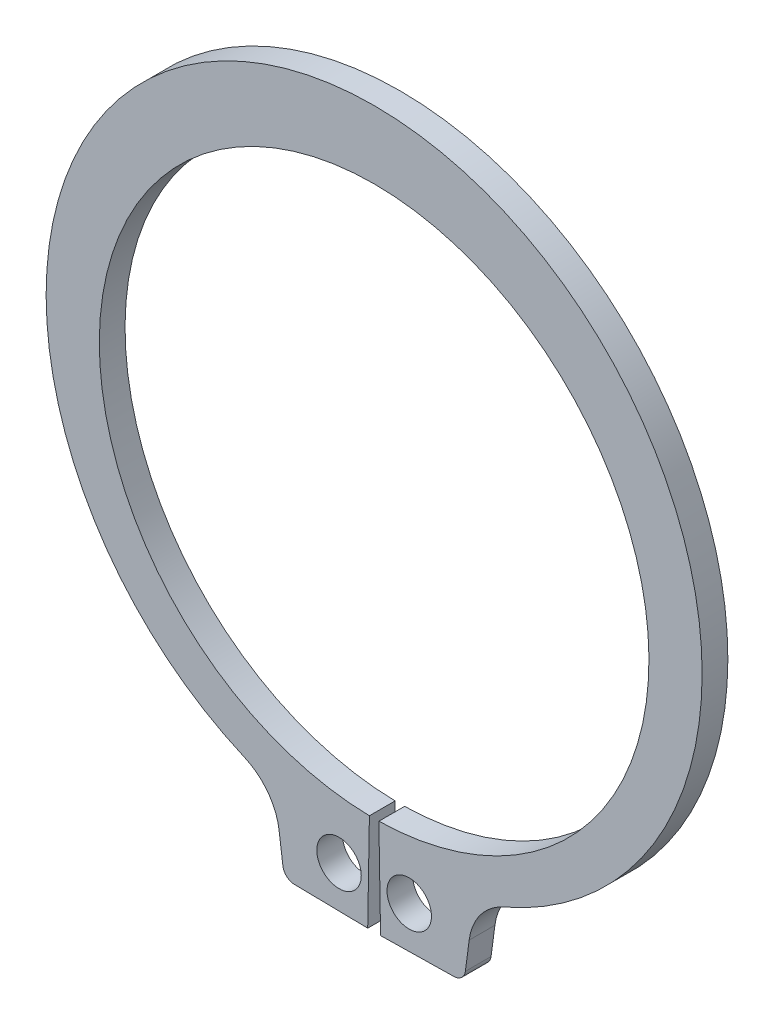
ISO-10303-21;
HEADER;
FILE_DESCRIPTION(('STEP AP214'),'2;1');
FILE_NAME('part.step','',(''),(''),'','','');
FILE_SCHEMA(('AUTOMOTIVE_DESIGN { 1 0 10303 214 1 1 1 1 }'));
ENDSEC;
DATA;
#1=APPLICATION_CONTEXT('core data for automotive mechanical design processes');
#2=APPLICATION_PROTOCOL_DEFINITION('international standard','automotive_design',2000,#1);
#3=PRODUCT_CONTEXT('',#1,'mechanical');
#4=PRODUCT('Part','Part','',(#3));
#5=PRODUCT_RELATED_PRODUCT_CATEGORY('part','',(#4));
#6=PRODUCT_DEFINITION_FORMATION('','',#4);
#7=PRODUCT_DEFINITION_CONTEXT('part definition',#1,'design');
#8=PRODUCT_DEFINITION('design','',#6,#7);
#9=PRODUCT_DEFINITION_SHAPE('','',#8);
#10=(LENGTH_UNIT() NAMED_UNIT(*) SI_UNIT(.MILLI.,.METRE.));
#11=(NAMED_UNIT(*) PLANE_ANGLE_UNIT() SI_UNIT($,.RADIAN.));
#12=(NAMED_UNIT(*) SI_UNIT($,.STERADIAN.) SOLID_ANGLE_UNIT());
#13=UNCERTAINTY_MEASURE_WITH_UNIT(LENGTH_MEASURE(1.E-05),#10,'distance_accuracy_value','');
#14=(GEOMETRIC_REPRESENTATION_CONTEXT(3) GLOBAL_UNCERTAINTY_ASSIGNED_CONTEXT((#13)) GLOBAL_UNIT_ASSIGNED_CONTEXT((#10,
#11,#12)) REPRESENTATION_CONTEXT('',''));
#15=CARTESIAN_POINT('',(0.,0.,0.));
#16=DIRECTION('',(0.,0.,1.));
#17=DIRECTION('',(1.,0.,0.));
#18=AXIS2_PLACEMENT_3D('',#15,#16,#17);
#19=CARTESIAN_POINT('',(0.,0.,-1.1));
#20=DIRECTION('',(0.,0.,1.));
#21=DIRECTION('',(1.,0.,0.));
#22=AXIS2_PLACEMENT_3D('',#19,#20,#21);
#23=CYLINDRICAL_SURFACE('',#22,11.75);
#24=CARTESIAN_POINT('',(0.,0.,0.));
#25=DIRECTION('',(0.,0.,-1.));
#26=DIRECTION('',(1.,0.,0.));
#27=AXIS2_PLACEMENT_3D('',#24,#25,#26);
#28=CIRCLE('',#27,11.75);
#29=CARTESIAN_POINT('',(-0.202586206896552,-11.7482534373742,0.));
#30=VERTEX_POINT('',#29);
#31=CARTESIAN_POINT('',(0.202586206896552,-11.7482534373742,0.));
#32=VERTEX_POINT('',#31);
#33=EDGE_CURVE('E170',#30,#32,#28,.T.);
#34=ORIENTED_EDGE('',*,*,#33,.F.);
#35=DIRECTION('',(0.,0.,1.));
#36=VECTOR('',#35,1.);
#37=CARTESIAN_POINT('',(-0.202586206896552,-11.7482534373742,-1.1));
#38=LINE('',#37,#36);
#39=CARTESIAN_POINT('',(-0.202586206896552,-11.7482534373742,-1.1));
#40=VERTEX_POINT('',#39);
#41=EDGE_CURVE('E11',#40,#30,#38,.T.);
#42=ORIENTED_EDGE('',*,*,#41,.F.);
#43=CARTESIAN_POINT('',(0.,0.,-1.1));
#44=DIRECTION('',(0.,0.,-1.));
#45=DIRECTION('',(1.,0.,0.));
#46=AXIS2_PLACEMENT_3D('',#43,#44,#45);
#47=CIRCLE('',#46,11.75);
#48=CARTESIAN_POINT('',(0.202586206896552,-11.7482534373742,-1.1));
#49=VERTEX_POINT('',#48);
#50=EDGE_CURVE('E215',#40,#49,#47,.T.);
#51=ORIENTED_EDGE('',*,*,#50,.T.);
#52=DIRECTION('',(0.,0.,1.));
#53=VECTOR('',#52,1.);
#54=CARTESIAN_POINT('',(0.202586206896552,-11.7482534373742,-1.1));
#55=LINE('',#54,#53);
#56=EDGE_CURVE('E46',#49,#32,#55,.T.);
#57=ORIENTED_EDGE('',*,*,#56,.T.);
#58=EDGE_LOOP('',(#34,#42,#51,#57));
#59=FACE_BOUND('',#58,.T.);
#60=ADVANCED_FACE('F43',(#59),#23,.F.);
#61=CARTESIAN_POINT('',(-0.202586206896552,-11.7482534373742,-1.1));
#62=DIRECTION('',(0.999851356372275,-0.0172413793103448,0.));
#63=DIRECTION('',(0.0172413793103448,0.999851356372275,0.));
#64=AXIS2_PLACEMENT_3D('',#61,#62,#63);
#65=PLANE('',#64);
#66=DIRECTION('',(0.0172413793103448,0.999851356372274,0.));
#67=VECTOR('',#66,1.);
#68=CARTESIAN_POINT('',(-0.202586206896552,-11.7482534373742,0.));
#69=LINE('',#68,#67);
#70=CARTESIAN_POINT('',(-0.275,-15.9476291341378,0.));
#71=VERTEX_POINT('',#70);
#72=EDGE_CURVE('E212',#71,#30,#69,.T.);
#73=ORIENTED_EDGE('',*,*,#72,.F.);
#74=DIRECTION('',(0.,0.,1.));
#75=VECTOR('',#74,1.);
#76=CARTESIAN_POINT('',(-0.275,-15.9476291341378,-1.1));
#77=LINE('',#76,#75);
#78=CARTESIAN_POINT('',(-0.275,-15.9476291341378,-1.1));
#79=VERTEX_POINT('',#78);
#80=EDGE_CURVE('E53',#79,#71,#77,.T.);
#81=ORIENTED_EDGE('',*,*,#80,.F.);
#82=DIRECTION('',(0.0172413793103448,0.999851356372274,0.));
#83=VECTOR('',#82,1.);
#84=CARTESIAN_POINT('',(-0.202586206896552,-11.7482534373742,-1.1));
#85=LINE('',#84,#83);
#86=EDGE_CURVE('E156',#79,#40,#85,.T.);
#87=ORIENTED_EDGE('',*,*,#86,.T.);
#88=ORIENTED_EDGE('',*,*,#41,.T.);
#89=EDGE_LOOP('',(#73,#81,#87,#88));
#90=FACE_BOUND('',#89,.T.);
#91=ADVANCED_FACE('F245',(#90),#65,.T.);
#92=CARTESIAN_POINT('',(-0.275,-15.9476291341378,-1.1));
#93=DIRECTION('',(-0.0172413793103458,-0.999851356372275,0.));
#94=DIRECTION('',(0.999851356372274,-0.0172413793103457,0.));
#95=AXIS2_PLACEMENT_3D('',#92,#93,#94);
#96=PLANE('',#95);
#97=DIRECTION('',(0.999851356372274,-0.0172413793103457,0.));
#98=VECTOR('',#97,1.);
#99=CARTESIAN_POINT('',(-0.275,-15.9476291341378,0.));
#100=LINE('',#99,#98);
#101=CARTESIAN_POINT('',(-3.41293614914244,-15.893518743574,0.));
#102=VERTEX_POINT('',#101);
#103=EDGE_CURVE('E142',#102,#71,#100,.T.);
#104=ORIENTED_EDGE('',*,*,#103,.F.);
#105=DIRECTION('',(0.,0.,1.));
#106=VECTOR('',#105,1.);
#107=CARTESIAN_POINT('',(-3.41293614914244,-15.893518743574,-1.1));
#108=LINE('',#107,#106);
#109=CARTESIAN_POINT('',(-3.41293614914244,-15.893518743574,-1.1));
#110=VERTEX_POINT('',#109);
#111=EDGE_CURVE('E137',#110,#102,#108,.T.);
#112=ORIENTED_EDGE('',*,*,#111,.F.);
#113=DIRECTION('',(0.999851356372274,-0.0172413793103457,0.));
#114=VECTOR('',#113,1.);
#115=CARTESIAN_POINT('',(-0.275,-15.9476291341378,-1.1));
#116=LINE('',#115,#114);
#117=EDGE_CURVE('E140',#110,#79,#116,.T.);
#118=ORIENTED_EDGE('',*,*,#117,.T.);
#119=ORIENTED_EDGE('',*,*,#80,.T.);
#120=EDGE_LOOP('',(#104,#112,#118,#119));
#121=FACE_BOUND('',#120,.T.);
#122=ADVANCED_FACE('F139',(#121),#96,.T.);
#123=CARTESIAN_POINT('',(-3.40431545948726,-15.3935930653879,-1.1));
#124=DIRECTION('',(0.,0.,1.));
#125=DIRECTION('',(1.,0.,0.));
#126=AXIS2_PLACEMENT_3D('',#123,#124,#125);
#127=CYLINDRICAL_SURFACE('',#126,0.499999999999999);
#128=CARTESIAN_POINT('',(-3.40431545948726,-15.3935930653879,0.));
#129=DIRECTION('',(0.,0.,1.));
#130=DIRECTION('',(1.,0.,0.));
#131=AXIS2_PLACEMENT_3D('',#128,#129,#130);
#132=CIRCLE('',#131,0.499999999999999);
#133=CARTESIAN_POINT('',(-3.90003789017417,-15.4588561614979,0.));
#134=VERTEX_POINT('',#133);
#135=EDGE_CURVE('E207',#134,#102,#132,.T.);
#136=ORIENTED_EDGE('',*,*,#135,.F.);
#137=DIRECTION('',(0.,0.,1.));
#138=VECTOR('',#137,1.);
#139=CARTESIAN_POINT('',(-3.90003789017417,-15.4588561614979,-1.1));
#140=LINE('',#139,#138);
#141=CARTESIAN_POINT('',(-3.90003789017417,-15.4588561614979,-1.1));
#142=VERTEX_POINT('',#141);
#143=EDGE_CURVE('E148',#142,#134,#140,.T.);
#144=ORIENTED_EDGE('',*,*,#143,.F.);
#145=CARTESIAN_POINT('',(-3.40431545948726,-15.3935930653879,-1.1));
#146=DIRECTION('',(0.,0.,1.));
#147=DIRECTION('',(1.,0.,0.));
#148=AXIS2_PLACEMENT_3D('',#145,#146,#147);
#149=CIRCLE('',#148,0.499999999999999);
#150=EDGE_CURVE('E154',#142,#110,#149,.T.);
#151=ORIENTED_EDGE('',*,*,#150,.T.);
#152=ORIENTED_EDGE('',*,*,#111,.T.);
#153=EDGE_LOOP('',(#136,#144,#151,#152));
#154=FACE_BOUND('',#153,.T.);
#155=ADVANCED_FACE('F159',(#154),#127,.T.);
#156=CARTESIAN_POINT('',(-4.06304644435678,-14.220683265656,-1.1));
#157=DIRECTION('',(-0.99144486137381,-0.130526192220053,0.));
#158=DIRECTION('',(0.130526192220053,-0.99144486137381,0.));
#159=AXIS2_PLACEMENT_3D('',#156,#157,#158);
#160=PLANE('',#159);
#161=DIRECTION('',(0.130526192220053,-0.99144486137381,0.));
#162=VECTOR('',#161,1.);
#163=CARTESIAN_POINT('',(-4.06304644435678,-14.220683265656,0.));
#164=LINE('',#163,#162);
#165=CARTESIAN_POINT('',(-4.06304644435678,-14.220683265656,0.));
#166=VERTEX_POINT('',#165);
#167=EDGE_CURVE('E203',#166,#134,#164,.T.);
#168=ORIENTED_EDGE('',*,*,#167,.F.);
#169=DIRECTION('',(0.,0.,1.));
#170=VECTOR('',#169,1.);
#171=CARTESIAN_POINT('',(-4.06304644435678,-14.220683265656,-1.1));
#172=LINE('',#171,#170);
#173=CARTESIAN_POINT('',(-4.06304644435678,-14.220683265656,-1.1));
#174=VERTEX_POINT('',#173);
#175=EDGE_CURVE('E221',#174,#166,#172,.T.);
#176=ORIENTED_EDGE('',*,*,#175,.F.);
#177=DIRECTION('',(0.130526192220053,-0.99144486137381,0.));
#178=VECTOR('',#177,1.);
#179=CARTESIAN_POINT('',(-4.06304644435678,-14.220683265656,-1.1));
#180=LINE('',#179,#178);
#181=EDGE_CURVE('E161',#174,#142,#180,.T.);
#182=ORIENTED_EDGE('',*,*,#181,.T.);
#183=ORIENTED_EDGE('',*,*,#143,.T.);
#184=EDGE_LOOP('',(#168,#176,#182,#183));
#185=FACE_BOUND('',#184,.T.);
#186=ADVANCED_FACE('F258',(#185),#160,.T.);
#187=CARTESIAN_POINT('',(-6.54130563604714,-14.5469522779109,-1.1));
#188=DIRECTION('',(0.,0.,1.));
#189=DIRECTION('',(1.,0.,0.));
#190=AXIS2_PLACEMENT_3D('',#187,#188,#189);
#191=CYLINDRICAL_SURFACE('',#190,2.49964399256286);
#192=CARTESIAN_POINT('',(-6.54130563604714,-14.5469522779109,0.));
#193=DIRECTION('',(0.,0.,-1.));
#194=DIRECTION('',(1.,0.,0.));
#195=AXIS2_PLACEMENT_3D('',#192,#193,#194);
#196=CIRCLE('',#195,2.49964399256286);
#197=CARTESIAN_POINT('',(-5.55173550673059,-12.2515283413101,0.));
#198=VERTEX_POINT('',#197);
#199=EDGE_CURVE('E199',#198,#166,#196,.T.);
#200=ORIENTED_EDGE('',*,*,#199,.F.);
#201=DIRECTION('',(0.,0.,1.));
#202=VECTOR('',#201,1.);
#203=CARTESIAN_POINT('',(-5.55173550673059,-12.2515283413101,-1.1));
#204=LINE('',#203,#202);
#205=CARTESIAN_POINT('',(-5.55173550673059,-12.2515283413101,-1.1));
#206=VERTEX_POINT('',#205);
#207=EDGE_CURVE('E224',#206,#198,#204,.T.);
#208=ORIENTED_EDGE('',*,*,#207,.F.);
#209=CARTESIAN_POINT('',(-6.54130563604714,-14.5469522779109,-1.1));
#210=DIRECTION('',(0.,0.,-1.));
#211=DIRECTION('',(1.,0.,0.));
#212=AXIS2_PLACEMENT_3D('',#209,#210,#211);
#213=CIRCLE('',#212,2.49964399256286);
#214=EDGE_CURVE('E164',#206,#174,#213,.T.);
#215=ORIENTED_EDGE('',*,*,#214,.T.);
#216=ORIENTED_EDGE('',*,*,#175,.T.);
#217=EDGE_LOOP('',(#200,#208,#215,#216));
#218=FACE_BOUND('',#217,.T.);
#219=ADVANCED_FACE('F261',(#218),#191,.F.);
#220=CARTESIAN_POINT('',(0.,0.626373076982971,-1.1));
#221=DIRECTION('',(0.,0.,1.));
#222=DIRECTION('',(1.,0.,0.));
#223=AXIS2_PLACEMENT_3D('',#220,#221,#222);
#224=CYLINDRICAL_SURFACE('',#223,14.023626923017);
#225=CARTESIAN_POINT('',(0.,0.626373076982971,0.));
#226=DIRECTION('',(0.,0.,1.));
#227=DIRECTION('',(1.,0.,0.));
#228=AXIS2_PLACEMENT_3D('',#225,#226,#227);
#229=CIRCLE('',#228,14.023626923017);
#230=CARTESIAN_POINT('',(5.55173550673059,-12.2515283413101,0.));
#231=VERTEX_POINT('',#230);
#232=EDGE_CURVE('E195',#231,#198,#229,.T.);
#233=ORIENTED_EDGE('',*,*,#232,.F.);
#234=DIRECTION('',(0.,0.,1.));
#235=VECTOR('',#234,1.);
#236=CARTESIAN_POINT('',(5.55173550673059,-12.2515283413101,-1.1));
#237=LINE('',#236,#235);
#238=CARTESIAN_POINT('',(5.55173550673059,-12.2515283413101,-1.1));
#239=VERTEX_POINT('',#238);
#240=EDGE_CURVE('E227',#239,#231,#237,.T.);
#241=ORIENTED_EDGE('',*,*,#240,.F.);
#242=CARTESIAN_POINT('',(0.,0.626373076982971,-1.1));
#243=DIRECTION('',(0.,0.,1.));
#244=DIRECTION('',(1.,0.,0.));
#245=AXIS2_PLACEMENT_3D('',#242,#243,#244);
#246=CIRCLE('',#245,14.023626923017);
#247=EDGE_CURVE('E345',#239,#206,#246,.T.);
#248=ORIENTED_EDGE('',*,*,#247,.T.);
#249=ORIENTED_EDGE('',*,*,#207,.T.);
#250=EDGE_LOOP('',(#233,#241,#248,#249));
#251=FACE_BOUND('',#250,.T.);
#252=ADVANCED_FACE('F265',(#251),#224,.T.);
#253=CARTESIAN_POINT('',(6.54130563604714,-14.5469522779109,-1.1));
#254=DIRECTION('',(0.,0.,1.));
#255=DIRECTION('',(1.,0.,0.));
#256=AXIS2_PLACEMENT_3D('',#253,#254,#255);
#257=CYLINDRICAL_SURFACE('',#256,2.49964399256286);
#258=CARTESIAN_POINT('',(6.54130563604714,-14.5469522779109,0.));
#259=DIRECTION('',(0.,0.,-1.));
#260=DIRECTION('',(1.,0.,0.));
#261=AXIS2_PLACEMENT_3D('',#258,#259,#260);
#262=CIRCLE('',#261,2.49964399256286);
#263=CARTESIAN_POINT('',(4.06304644435678,-14.220683265656,0.));
#264=VERTEX_POINT('',#263);
#265=EDGE_CURVE('E191',#264,#231,#262,.T.);
#266=ORIENTED_EDGE('',*,*,#265,.F.);
#267=DIRECTION('',(0.,0.,1.));
#268=VECTOR('',#267,1.);
#269=CARTESIAN_POINT('',(4.06304644435678,-14.220683265656,-1.1));
#270=LINE('',#269,#268);
#271=CARTESIAN_POINT('',(4.06304644435678,-14.220683265656,-1.1));
#272=VERTEX_POINT('',#271);
#273=EDGE_CURVE('E230',#272,#264,#270,.T.);
#274=ORIENTED_EDGE('',*,*,#273,.F.);
#275=CARTESIAN_POINT('',(6.54130563604714,-14.5469522779109,-1.1));
#276=DIRECTION('',(0.,0.,-1.));
#277=DIRECTION('',(1.,0.,0.));
#278=AXIS2_PLACEMENT_3D('',#275,#276,#277);
#279=CIRCLE('',#278,2.49964399256286);
#280=EDGE_CURVE('E341',#272,#239,#279,.T.);
#281=ORIENTED_EDGE('',*,*,#280,.T.);
#282=ORIENTED_EDGE('',*,*,#240,.T.);
#283=EDGE_LOOP('',(#266,#274,#281,#282));
#284=FACE_BOUND('',#283,.T.);
#285=ADVANCED_FACE('F269',(#284),#257,.F.);
#286=CARTESIAN_POINT('',(4.06304644435678,-14.220683265656,-1.1));
#287=DIRECTION('',(0.99144486137381,-0.130526192220053,0.));
#288=DIRECTION('',(0.130526192220053,0.99144486137381,0.));
#289=AXIS2_PLACEMENT_3D('',#286,#287,#288);
#290=PLANE('',#289);
#291=DIRECTION('',(0.130526192220053,0.99144486137381,0.));
#292=VECTOR('',#291,1.);
#293=CARTESIAN_POINT('',(4.06304644435678,-14.220683265656,0.));
#294=LINE('',#293,#292);
#295=CARTESIAN_POINT('',(3.90003789017417,-15.4588561614979,0.));
#296=VERTEX_POINT('',#295);
#297=EDGE_CURVE('E187',#296,#264,#294,.T.);
#298=ORIENTED_EDGE('',*,*,#297,.F.);
#299=DIRECTION('',(0.,0.,1.));
#300=VECTOR('',#299,1.);
#301=CARTESIAN_POINT('',(3.90003789017417,-15.4588561614979,-1.1));
#302=LINE('',#301,#300);
#303=CARTESIAN_POINT('',(3.90003789017417,-15.4588561614979,-1.1));
#304=VERTEX_POINT('',#303);
#305=EDGE_CURVE('E233',#304,#296,#302,.T.);
#306=ORIENTED_EDGE('',*,*,#305,.F.);
#307=DIRECTION('',(0.130526192220053,0.99144486137381,0.));
#308=VECTOR('',#307,1.);
#309=CARTESIAN_POINT('',(4.06304644435678,-14.220683265656,-1.1));
#310=LINE('',#309,#308);
#311=EDGE_CURVE('E337',#304,#272,#310,.T.);
#312=ORIENTED_EDGE('',*,*,#311,.T.);
#313=ORIENTED_EDGE('',*,*,#273,.T.);
#314=EDGE_LOOP('',(#298,#306,#312,#313));
#315=FACE_BOUND('',#314,.T.);
#316=ADVANCED_FACE('F273',(#315),#290,.T.);
#317=CARTESIAN_POINT('',(3.40431545948726,-15.3935930653879,-1.1));
#318=DIRECTION('',(0.,0.,1.));
#319=DIRECTION('',(1.,0.,0.));
#320=AXIS2_PLACEMENT_3D('',#317,#318,#319);
#321=CYLINDRICAL_SURFACE('',#320,0.499999999999999);
#322=CARTESIAN_POINT('',(3.40431545948726,-15.3935930653879,0.));
#323=DIRECTION('',(0.,0.,1.));
#324=DIRECTION('',(-1.,0.,0.));
#325=AXIS2_PLACEMENT_3D('',#322,#323,#324);
#326=CIRCLE('',#325,0.499999999999999);
#327=CARTESIAN_POINT('',(3.41293614914244,-15.893518743574,0.));
#328=VERTEX_POINT('',#327);
#329=EDGE_CURVE('E183',#328,#296,#326,.T.);
#330=ORIENTED_EDGE('',*,*,#329,.F.);
#331=DIRECTION('',(0.,0.,1.));
#332=VECTOR('',#331,1.);
#333=CARTESIAN_POINT('',(3.41293614914244,-15.893518743574,-1.1));
#334=LINE('',#333,#332);
#335=CARTESIAN_POINT('',(3.41293614914244,-15.893518743574,-1.1));
#336=VERTEX_POINT('',#335);
#337=EDGE_CURVE('E236',#336,#328,#334,.T.);
#338=ORIENTED_EDGE('',*,*,#337,.F.);
#339=CARTESIAN_POINT('',(3.40431545948726,-15.3935930653879,-1.1));
#340=DIRECTION('',(0.,0.,1.));
#341=DIRECTION('',(-1.,0.,0.));
#342=AXIS2_PLACEMENT_3D('',#339,#340,#341);
#343=CIRCLE('',#342,0.499999999999999);
#344=EDGE_CURVE('E333',#336,#304,#343,.T.);
#345=ORIENTED_EDGE('',*,*,#344,.T.);
#346=ORIENTED_EDGE('',*,*,#305,.T.);
#347=EDGE_LOOP('',(#330,#338,#345,#346));
#348=FACE_BOUND('',#347,.T.);
#349=ADVANCED_FACE('F277',(#348),#321,.T.);
#350=CARTESIAN_POINT('',(0.275,-15.9476291341378,-1.1));
#351=DIRECTION('',(0.0172413793103458,-0.999851356372275,0.));
#352=DIRECTION('',(0.999851356372274,0.0172413793103457,0.));
#353=AXIS2_PLACEMENT_3D('',#350,#351,#352);
#354=PLANE('',#353);
#355=DIRECTION('',(0.999851356372274,0.0172413793103457,0.));
#356=VECTOR('',#355,1.);
#357=CARTESIAN_POINT('',(0.275,-15.9476291341378,0.));
#358=LINE('',#357,#356);
#359=CARTESIAN_POINT('',(0.275,-15.9476291341378,0.));
#360=VERTEX_POINT('',#359);
#361=EDGE_CURVE('E179',#360,#328,#358,.T.);
#362=ORIENTED_EDGE('',*,*,#361,.F.);
#363=DIRECTION('',(0.,0.,1.));
#364=VECTOR('',#363,1.);
#365=CARTESIAN_POINT('',(0.275,-15.9476291341378,-1.1));
#366=LINE('',#365,#364);
#367=CARTESIAN_POINT('',(0.275,-15.9476291341378,-1.1));
#368=VERTEX_POINT('',#367);
#369=EDGE_CURVE('E238',#368,#360,#366,.T.);
#370=ORIENTED_EDGE('',*,*,#369,.F.);
#371=DIRECTION('',(0.999851356372274,0.0172413793103457,0.));
#372=VECTOR('',#371,1.);
#373=CARTESIAN_POINT('',(0.275,-15.9476291341378,-1.1));
#374=LINE('',#373,#372);
#375=EDGE_CURVE('E329',#368,#336,#374,.T.);
#376=ORIENTED_EDGE('',*,*,#375,.T.);
#377=ORIENTED_EDGE('',*,*,#337,.T.);
#378=EDGE_LOOP('',(#362,#370,#376,#377));
#379=FACE_BOUND('',#378,.T.);
#380=ADVANCED_FACE('F281',(#379),#354,.T.);
#381=CARTESIAN_POINT('',(0.202586206896552,-11.7482534373742,-1.1));
#382=DIRECTION('',(-0.999851356372275,-0.0172413793103448,0.));
#383=DIRECTION('',(0.0172413793103448,-0.999851356372275,0.));
#384=AXIS2_PLACEMENT_3D('',#381,#382,#383);
#385=PLANE('',#384);
#386=DIRECTION('',(0.0172413793103448,-0.999851356372274,0.));
#387=VECTOR('',#386,1.);
#388=CARTESIAN_POINT('',(0.202586206896552,-11.7482534373742,0.));
#389=LINE('',#388,#387);
#390=EDGE_CURVE('E174',#32,#360,#389,.T.);
#391=ORIENTED_EDGE('',*,*,#390,.F.);
#392=ORIENTED_EDGE('',*,*,#56,.F.);
#393=DIRECTION('',(0.0172413793103448,-0.999851356372274,0.));
#394=VECTOR('',#393,1.);
#395=CARTESIAN_POINT('',(0.202586206896552,-11.7482534373742,-1.1));
#396=LINE('',#395,#394);
#397=EDGE_CURVE('E326',#49,#368,#396,.T.);
#398=ORIENTED_EDGE('',*,*,#397,.T.);
#399=ORIENTED_EDGE('',*,*,#369,.T.);
#400=EDGE_LOOP('',(#391,#392,#398,#399));
#401=FACE_BOUND('',#400,.T.);
#402=ADVANCED_FACE('F242',(#401),#385,.T.);
#403=CARTESIAN_POINT('',(0.,0.,-1.1));
#404=DIRECTION('',(0.,0.,1.));
#405=DIRECTION('',(1.,0.,0.));
#406=AXIS2_PLACEMENT_3D('',#403,#404,#405);
#407=PLANE('',#406);
#408=CARTESIAN_POINT('',(-1.5,-14.1456928073531,-1.1));
#409=DIRECTION('',(0.,0.,1.));
#410=DIRECTION('',(1.,0.,0.));
#411=AXIS2_PLACEMENT_3D('',#408,#409,#410);
#412=CIRCLE('',#411,0.95);
#413=CARTESIAN_POINT('',(-0.55,-14.1456928073531,-1.1));
#414=VERTEX_POINT('',#413);
#415=EDGE_CURVE('E308',#414,#414,#412,.T.);
#416=ORIENTED_EDGE('',*,*,#415,.T.);
#417=EDGE_LOOP('',(#416));
#418=FACE_BOUND('',#417,.T.);
#419=CARTESIAN_POINT('',(1.5,-14.1456928073531,-1.1));
#420=DIRECTION('',(0.,0.,1.));
#421=DIRECTION('',(1.,0.,0.));
#422=AXIS2_PLACEMENT_3D('',#419,#420,#421);
#423=CIRCLE('',#422,0.95);
#424=CARTESIAN_POINT('',(2.45,-14.1456928073531,-1.1));
#425=VERTEX_POINT('',#424);
#426=EDGE_CURVE('E175',#425,#425,#423,.T.);
#427=ORIENTED_EDGE('',*,*,#426,.T.);
#428=EDGE_LOOP('',(#427));
#429=FACE_BOUND('',#428,.T.);
#430=ORIENTED_EDGE('',*,*,#50,.F.);
#431=ORIENTED_EDGE('',*,*,#86,.F.);
#432=ORIENTED_EDGE('',*,*,#117,.F.);
#433=ORIENTED_EDGE('',*,*,#150,.F.);
#434=ORIENTED_EDGE('',*,*,#181,.F.);
#435=ORIENTED_EDGE('',*,*,#214,.F.);
#436=ORIENTED_EDGE('',*,*,#247,.F.);
#437=ORIENTED_EDGE('',*,*,#280,.F.);
#438=ORIENTED_EDGE('',*,*,#311,.F.);
#439=ORIENTED_EDGE('',*,*,#344,.F.);
#440=ORIENTED_EDGE('',*,*,#375,.F.);
#441=ORIENTED_EDGE('',*,*,#397,.F.);
#442=EDGE_LOOP('',(#430,#431,#432,#433,#434,#435,#436,#437,#438,#439,#440,#441));
#443=FACE_BOUND('',#442,.T.);
#444=ADVANCED_FACE('F152',(#418,#429,#443),#407,.F.);
#445=CARTESIAN_POINT('',(0.,0.,0.));
#446=DIRECTION('',(0.,0.,1.));
#447=DIRECTION('',(1.,0.,0.));
#448=AXIS2_PLACEMENT_3D('',#445,#446,#447);
#449=PLANE('',#448);
#450=CARTESIAN_POINT('',(-1.5,-14.1456928073531,0.));
#451=DIRECTION('',(0.,0.,1.));
#452=DIRECTION('',(1.,0.,0.));
#453=AXIS2_PLACEMENT_3D('',#450,#451,#452);
#454=CIRCLE('',#453,0.95);
#455=CARTESIAN_POINT('',(-0.55,-14.1456928073531,0.));
#456=VERTEX_POINT('',#455);
#457=EDGE_CURVE('E311',#456,#456,#454,.T.);
#458=ORIENTED_EDGE('',*,*,#457,.F.);
#459=EDGE_LOOP('',(#458));
#460=FACE_BOUND('',#459,.T.);
#461=CARTESIAN_POINT('',(1.5,-14.1456928073531,0.));
#462=DIRECTION('',(0.,0.,1.));
#463=DIRECTION('',(1.,0.,0.));
#464=AXIS2_PLACEMENT_3D('',#461,#462,#463);
#465=CIRCLE('',#464,0.95);
#466=CARTESIAN_POINT('',(2.45,-14.1456928073531,0.));
#467=VERTEX_POINT('',#466);
#468=EDGE_CURVE('E315',#467,#467,#465,.T.);
#469=ORIENTED_EDGE('',*,*,#468,.F.);
#470=EDGE_LOOP('',(#469));
#471=FACE_BOUND('',#470,.T.);
#472=ORIENTED_EDGE('',*,*,#33,.T.);
#473=ORIENTED_EDGE('',*,*,#390,.T.);
#474=ORIENTED_EDGE('',*,*,#361,.T.);
#475=ORIENTED_EDGE('',*,*,#329,.T.);
#476=ORIENTED_EDGE('',*,*,#297,.T.);
#477=ORIENTED_EDGE('',*,*,#265,.T.);
#478=ORIENTED_EDGE('',*,*,#232,.T.);
#479=ORIENTED_EDGE('',*,*,#199,.T.);
#480=ORIENTED_EDGE('',*,*,#167,.T.);
#481=ORIENTED_EDGE('',*,*,#135,.T.);
#482=ORIENTED_EDGE('',*,*,#103,.T.);
#483=ORIENTED_EDGE('',*,*,#72,.T.);
#484=EDGE_LOOP('',(#472,#473,#474,#475,#476,#477,#478,#479,#480,#481,#482,#483));
#485=FACE_BOUND('',#484,.T.);
#486=ADVANCED_FACE('F244',(#460,#471,#485),#449,.T.);
#487=CARTESIAN_POINT('',(1.5,-14.1456928073531,-1.1));
#488=DIRECTION('',(0.,0.,1.));
#489=DIRECTION('',(1.,0.,0.));
#490=AXIS2_PLACEMENT_3D('',#487,#488,#489);
#491=CYLINDRICAL_SURFACE('',#490,0.95);
#492=ORIENTED_EDGE('',*,*,#426,.F.);
#493=EDGE_LOOP('',(#492));
#494=FACE_BOUND('',#493,.T.);
#495=ORIENTED_EDGE('',*,*,#468,.T.);
#496=EDGE_LOOP('',(#495));
#497=FACE_BOUND('',#496,.T.);
#498=ADVANCED_FACE('F293',(#494,#497),#491,.F.);
#499=CARTESIAN_POINT('',(-1.5,-14.1456928073531,-1.1));
#500=DIRECTION('',(0.,0.,1.));
#501=DIRECTION('',(1.,0.,0.));
#502=AXIS2_PLACEMENT_3D('',#499,#500,#501);
#503=CYLINDRICAL_SURFACE('',#502,0.95);
#504=ORIENTED_EDGE('',*,*,#415,.F.);
#505=EDGE_LOOP('',(#504));
#506=FACE_BOUND('',#505,.T.);
#507=ORIENTED_EDGE('',*,*,#457,.T.);
#508=EDGE_LOOP('',(#507));
#509=FACE_BOUND('',#508,.T.);
#510=ADVANCED_FACE('F300',(#506,#509),#503,.F.);
#511=CLOSED_SHELL('',(#60,#91,#122,#155,#186,#219,#252,#285,#316,#349,#380,#402,#444,#486,#498,#510));
#512=MANIFOLD_SOLID_BREP('B2',#511);
#513=ADVANCED_BREP_SHAPE_REPRESENTATION('',(#18,#512),#14);
#514=SHAPE_DEFINITION_REPRESENTATION(#9,#513);
ENDSEC;
END-ISO-10303-21;
